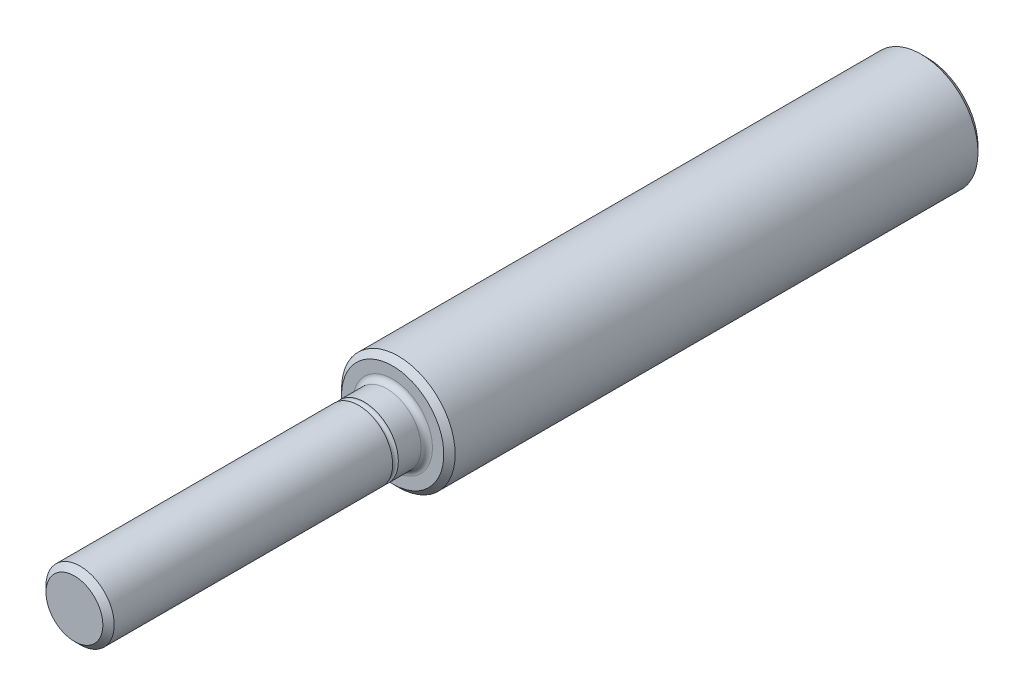
ISO-10303-21;
HEADER;
FILE_DESCRIPTION(('STEP AP214'),'2;1');
FILE_NAME('part.step','',(''),(''),'','','');
FILE_SCHEMA(('AUTOMOTIVE_DESIGN { 1 0 10303 214 1 1 1 1 }'));
ENDSEC;
DATA;
#1=APPLICATION_CONTEXT('core data for automotive mechanical design processes');
#2=APPLICATION_PROTOCOL_DEFINITION('international standard','automotive_design',2000,#1);
#3=PRODUCT_CONTEXT('',#1,'mechanical');
#4=PRODUCT('Part','Part','',(#3));
#5=PRODUCT_RELATED_PRODUCT_CATEGORY('part','',(#4));
#6=PRODUCT_DEFINITION_FORMATION('','',#4);
#7=PRODUCT_DEFINITION_CONTEXT('part definition',#1,'design');
#8=PRODUCT_DEFINITION('design','',#6,#7);
#9=PRODUCT_DEFINITION_SHAPE('','',#8);
#10=(LENGTH_UNIT() NAMED_UNIT(*) SI_UNIT(.MILLI.,.METRE.));
#11=(NAMED_UNIT(*) PLANE_ANGLE_UNIT() SI_UNIT($,.RADIAN.));
#12=(NAMED_UNIT(*) SI_UNIT($,.STERADIAN.) SOLID_ANGLE_UNIT());
#13=UNCERTAINTY_MEASURE_WITH_UNIT(LENGTH_MEASURE(1.E-05),#10,'distance_accuracy_value','');
#14=(GEOMETRIC_REPRESENTATION_CONTEXT(3) GLOBAL_UNCERTAINTY_ASSIGNED_CONTEXT((#13)) GLOBAL_UNIT_ASSIGNED_CONTEXT((#10,
#11,#12)) REPRESENTATION_CONTEXT('',''));
#15=CARTESIAN_POINT('',(0.,0.,0.));
#16=DIRECTION('',(0.,0.,1.));
#17=DIRECTION('',(1.,0.,0.));
#18=AXIS2_PLACEMENT_3D('',#15,#16,#17);
#19=CARTESIAN_POINT('',(0.,5.,-37.5));
#20=DIRECTION('',(0.,0.,1.));
#21=DIRECTION('',(1.,0.,0.));
#22=AXIS2_PLACEMENT_3D('',#19,#20,#21);
#23=PLANE('',#22);
#24=CARTESIAN_POINT('',(0.,0.,-37.5));
#25=DIRECTION('',(0.,0.,1.));
#26=DIRECTION('',(1.,0.,0.));
#27=AXIS2_PLACEMENT_3D('',#24,#25,#26);
#28=CIRCLE('',#27,4.5);
#29=CARTESIAN_POINT('',(4.5,0.,-37.5));
#30=VERTEX_POINT('',#29);
#31=EDGE_CURVE('E53',#30,#30,#28,.F.);
#32=ORIENTED_EDGE('',*,*,#31,.T.);
#33=EDGE_LOOP('',(#32));
#34=FACE_BOUND('',#33,.T.);
#35=ADVANCED_FACE('F37',(#34),#23,.F.);
#36=CARTESIAN_POINT('',(0.,0.,258.883884113946));
#37=DIRECTION('',(0.,0.,1.));
#38=DIRECTION('',(1.,0.,0.));
#39=AXIS2_PLACEMENT_3D('',#36,#37,#38);
#40=CYLINDRICAL_SURFACE('',#39,5.);
#41=CARTESIAN_POINT('',(0.,0.,-37.));
#42=DIRECTION('',(0.,0.,1.));
#43=DIRECTION('',(1.,0.,0.));
#44=AXIS2_PLACEMENT_3D('',#41,#42,#43);
#45=CIRCLE('',#44,5.);
#46=CARTESIAN_POINT('',(5.,0.,-37.));
#47=VERTEX_POINT('',#46);
#48=EDGE_CURVE('E58',#47,#47,#45,.T.);
#49=ORIENTED_EDGE('',*,*,#48,.T.);
#50=EDGE_LOOP('',(#49));
#51=FACE_BOUND('',#50,.T.);
#52=CARTESIAN_POINT('',(0.,0.,8.99999999999998));
#53=DIRECTION('',(0.,0.,-1.));
#54=DIRECTION('',(-1.,0.,0.));
#55=AXIS2_PLACEMENT_3D('',#52,#53,#54);
#56=CIRCLE('',#55,5.);
#57=CARTESIAN_POINT('',(-5.,0.,8.99999999999998));
#58=VERTEX_POINT('',#57);
#59=EDGE_CURVE('E61',#58,#58,#56,.T.);
#60=ORIENTED_EDGE('',*,*,#59,.T.);
#61=EDGE_LOOP('',(#60));
#62=FACE_BOUND('',#61,.T.);
#63=ADVANCED_FACE('F93',(#51,#62),#40,.T.);
#64=CARTESIAN_POINT('',(0.,3.,9.5));
#65=DIRECTION('',(0.,0.,-1.));
#66=DIRECTION('',(-1.,0.,0.));
#67=AXIS2_PLACEMENT_3D('',#64,#65,#66);
#68=PLANE('',#67);
#69=CARTESIAN_POINT('',(0.,0.,9.5));
#70=DIRECTION('',(0.,0.,-1.));
#71=DIRECTION('',(-1.,0.,0.));
#72=AXIS2_PLACEMENT_3D('',#69,#70,#71);
#73=CIRCLE('',#72,4.50000000000001);
#74=CARTESIAN_POINT('',(-4.50000000000001,0.,9.5));
#75=VERTEX_POINT('',#74);
#76=EDGE_CURVE('E49',#75,#75,#73,.F.);
#77=ORIENTED_EDGE('',*,*,#76,.T.);
#78=EDGE_LOOP('',(#77));
#79=FACE_BOUND('',#78,.T.);
#80=CARTESIAN_POINT('',(0.,0.,9.5));
#81=DIRECTION('',(0.,0.,-1.));
#82=DIRECTION('',(-1.,0.,0.));
#83=AXIS2_PLACEMENT_3D('',#80,#81,#82);
#84=CIRCLE('',#83,3.5);
#85=CARTESIAN_POINT('',(-3.5,0.,9.5));
#86=VERTEX_POINT('',#85);
#87=EDGE_CURVE('E64',#86,#86,#84,.T.);
#88=ORIENTED_EDGE('',*,*,#87,.T.);
#89=EDGE_LOOP('',(#88));
#90=FACE_BOUND('',#89,.T.);
#91=ADVANCED_FACE('F87',(#79,#90),#68,.F.);
#92=CARTESIAN_POINT('',(0.,0.,258.883884113946));
#93=DIRECTION('',(0.,0.,1.));
#94=DIRECTION('',(1.,0.,0.));
#95=AXIS2_PLACEMENT_3D('',#92,#93,#94);
#96=CYLINDRICAL_SURFACE('',#95,3.);
#97=CARTESIAN_POINT('',(0.,0.,10.));
#98=DIRECTION('',(0.,0.,-1.));
#99=DIRECTION('',(-1.,0.,0.));
#100=AXIS2_PLACEMENT_3D('',#97,#98,#99);
#101=CIRCLE('',#100,3.);
#102=CARTESIAN_POINT('',(-3.,0.,10.));
#103=VERTEX_POINT('',#102);
#104=EDGE_CURVE('E67',#103,#103,#101,.F.);
#105=ORIENTED_EDGE('',*,*,#104,.T.);
#106=EDGE_LOOP('',(#105));
#107=FACE_BOUND('',#106,.T.);
#108=CARTESIAN_POINT('',(0.,0.,12.));
#109=DIRECTION('',(0.,0.,1.));
#110=DIRECTION('',(1.,0.,0.));
#111=AXIS2_PLACEMENT_3D('',#108,#109,#110);
#112=CIRCLE('',#111,3.);
#113=CARTESIAN_POINT('',(3.,0.,12.));
#114=VERTEX_POINT('',#113);
#115=EDGE_CURVE('E70',#114,#114,#112,.T.);
#116=ORIENTED_EDGE('',*,*,#115,.F.);
#117=EDGE_LOOP('',(#116));
#118=FACE_BOUND('',#117,.T.);
#119=ADVANCED_FACE('F82',(#107,#118),#96,.T.);
#120=CARTESIAN_POINT('',(0.,0.,12.25));
#121=DIRECTION('',(0.,0.,1.));
#122=DIRECTION('',(1.,0.,0.));
#123=AXIS2_PLACEMENT_3D('',#120,#121,#122);
#124=TOROIDAL_SURFACE('',#123,3.,0.25);
#125=CARTESIAN_POINT('',(0.,0.,12.5));
#126=DIRECTION('',(0.,0.,1.));
#127=DIRECTION('',(1.,0.,0.));
#128=AXIS2_PLACEMENT_3D('',#125,#126,#127);
#129=CIRCLE('',#128,3.);
#130=CARTESIAN_POINT('',(3.,0.,12.5));
#131=VERTEX_POINT('',#130);
#132=EDGE_CURVE('E73',#131,#131,#129,.T.);
#133=ORIENTED_EDGE('',*,*,#132,.F.);
#134=EDGE_LOOP('',(#133));
#135=FACE_BOUND('',#134,.T.);
#136=ORIENTED_EDGE('',*,*,#115,.T.);
#137=EDGE_LOOP('',(#136));
#138=FACE_BOUND('',#137,.T.);
#139=ADVANCED_FACE('F79',(#135,#138),#124,.F.);
#140=CARTESIAN_POINT('',(0.,0.,258.883884113946));
#141=DIRECTION('',(0.,0.,1.));
#142=DIRECTION('',(1.,0.,0.));
#143=AXIS2_PLACEMENT_3D('',#140,#141,#142);
#144=CYLINDRICAL_SURFACE('',#143,3.);
#145=CARTESIAN_POINT('',(0.,0.,37.));
#146=DIRECTION('',(0.,0.,-1.));
#147=DIRECTION('',(-1.,0.,0.));
#148=AXIS2_PLACEMENT_3D('',#145,#146,#147);
#149=CIRCLE('',#148,3.);
#150=CARTESIAN_POINT('',(-3.,0.,37.));
#151=VERTEX_POINT('',#150);
#152=EDGE_CURVE('E10',#151,#151,#149,.T.);
#153=ORIENTED_EDGE('',*,*,#152,.T.);
#154=EDGE_LOOP('',(#153));
#155=FACE_BOUND('',#154,.T.);
#156=ORIENTED_EDGE('',*,*,#132,.T.);
#157=EDGE_LOOP('',(#156));
#158=FACE_BOUND('',#157,.T.);
#159=ADVANCED_FACE('F77',(#155,#158),#144,.T.);
#160=CARTESIAN_POINT('',(0.,0.,37.5));
#161=DIRECTION('',(0.,0.,-1.));
#162=DIRECTION('',(-1.,0.,0.));
#163=AXIS2_PLACEMENT_3D('',#160,#161,#162);
#164=PLANE('',#163);
#165=CARTESIAN_POINT('',(0.,0.,37.5));
#166=DIRECTION('',(0.,0.,-1.));
#167=DIRECTION('',(-1.,0.,0.));
#168=AXIS2_PLACEMENT_3D('',#165,#166,#167);
#169=CIRCLE('',#168,2.5);
#170=CARTESIAN_POINT('',(-2.5,0.,37.5));
#171=VERTEX_POINT('',#170);
#172=EDGE_CURVE('E45',#171,#171,#169,.F.);
#173=ORIENTED_EDGE('',*,*,#172,.T.);
#174=EDGE_LOOP('',(#173));
#175=FACE_BOUND('',#174,.T.);
#176=ADVANCED_FACE('F109',(#175),#164,.F.);
#177=CARTESIAN_POINT('',(0.,0.,10.));
#178=DIRECTION('',(0.,0.,-1.));
#179=DIRECTION('',(-1.,0.,0.));
#180=AXIS2_PLACEMENT_3D('',#177,#178,#179);
#181=TOROIDAL_SURFACE('',#180,3.5,0.5);
#182=ORIENTED_EDGE('',*,*,#87,.F.);
#183=EDGE_LOOP('',(#182));
#184=FACE_BOUND('',#183,.T.);
#185=ORIENTED_EDGE('',*,*,#104,.F.);
#186=EDGE_LOOP('',(#185));
#187=FACE_BOUND('',#186,.T.);
#188=ADVANCED_FACE('F105',(#184,#187),#181,.F.);
#189=CARTESIAN_POINT('',(0.,0.,-37.));
#190=DIRECTION('',(0.,0.,1.));
#191=DIRECTION('',(1.,0.,0.));
#192=AXIS2_PLACEMENT_3D('',#189,#190,#191);
#193=CONICAL_SURFACE('',#192,5.,0.785398163397437);
#194=ORIENTED_EDGE('',*,*,#31,.F.);
#195=EDGE_LOOP('',(#194));
#196=FACE_BOUND('',#195,.T.);
#197=ORIENTED_EDGE('',*,*,#48,.F.);
#198=EDGE_LOOP('',(#197));
#199=FACE_BOUND('',#198,.T.);
#200=ADVANCED_FACE('F108',(#196,#199),#193,.T.);
#201=CARTESIAN_POINT('',(0.,0.,9.50000000000001));
#202=DIRECTION('',(0.,0.,-1.));
#203=DIRECTION('',(-1.,0.,0.));
#204=AXIS2_PLACEMENT_3D('',#201,#202,#203);
#205=CONICAL_SURFACE('',#204,4.5,0.785398163397423);
#206=ORIENTED_EDGE('',*,*,#59,.F.);
#207=EDGE_LOOP('',(#206));
#208=FACE_BOUND('',#207,.T.);
#209=ORIENTED_EDGE('',*,*,#76,.F.);
#210=EDGE_LOOP('',(#209));
#211=FACE_BOUND('',#210,.T.);
#212=ADVANCED_FACE('F116',(#208,#211),#205,.T.);
#213=CARTESIAN_POINT('',(0.,0.,37.5));
#214=DIRECTION('',(0.,0.,-1.));
#215=DIRECTION('',(-1.,0.,0.));
#216=AXIS2_PLACEMENT_3D('',#213,#214,#215);
#217=CONICAL_SURFACE('',#216,2.49999999999999,0.785398163397453);
#218=ORIENTED_EDGE('',*,*,#152,.F.);
#219=EDGE_LOOP('',(#218));
#220=FACE_BOUND('',#219,.T.);
#221=ORIENTED_EDGE('',*,*,#172,.F.);
#222=EDGE_LOOP('',(#221));
#223=FACE_BOUND('',#222,.T.);
#224=ADVANCED_FACE('F40',(#220,#223),#217,.T.);
#225=CLOSED_SHELL('',(#35,#63,#91,#119,#139,#159,#176,#188,#200,#212,#224));
#226=MANIFOLD_SOLID_BREP('B2',#225);
#227=ADVANCED_BREP_SHAPE_REPRESENTATION('',(#18,#226),#14);
#228=SHAPE_DEFINITION_REPRESENTATION(#9,#227);
ENDSEC;
END-ISO-10303-21;
